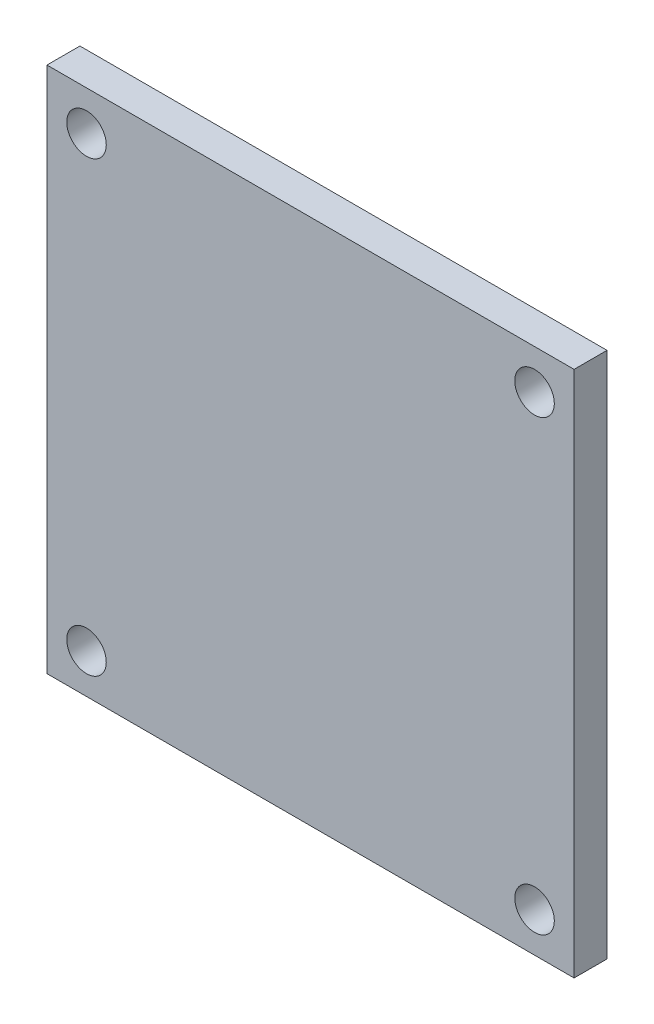
ISO-10303-21;
HEADER;
FILE_DESCRIPTION(('STEP AP214'),'2;1');
FILE_NAME('part.step','',(''),(''),'','','');
FILE_SCHEMA(('AUTOMOTIVE_DESIGN { 1 0 10303 214 1 1 1 1 }'));
ENDSEC;
DATA;
#1=APPLICATION_CONTEXT('core data for automotive mechanical design processes');
#2=APPLICATION_PROTOCOL_DEFINITION('international standard','automotive_design',2000,#1);
#3=PRODUCT_CONTEXT('',#1,'mechanical');
#4=PRODUCT('Part','Part','',(#3));
#5=PRODUCT_RELATED_PRODUCT_CATEGORY('part','',(#4));
#6=PRODUCT_DEFINITION_FORMATION('','',#4);
#7=PRODUCT_DEFINITION_CONTEXT('part definition',#1,'design');
#8=PRODUCT_DEFINITION('design','',#6,#7);
#9=PRODUCT_DEFINITION_SHAPE('','',#8);
#10=(LENGTH_UNIT() NAMED_UNIT(*) SI_UNIT(.MILLI.,.METRE.));
#11=(NAMED_UNIT(*) PLANE_ANGLE_UNIT() SI_UNIT($,.RADIAN.));
#12=(NAMED_UNIT(*) SI_UNIT($,.STERADIAN.) SOLID_ANGLE_UNIT());
#13=UNCERTAINTY_MEASURE_WITH_UNIT(LENGTH_MEASURE(1.E-05),#10,'distance_accuracy_value','');
#14=(GEOMETRIC_REPRESENTATION_CONTEXT(3) GLOBAL_UNCERTAINTY_ASSIGNED_CONTEXT((#13)) GLOBAL_UNIT_ASSIGNED_CONTEXT((#10,
#11,#12)) REPRESENTATION_CONTEXT('',''));
#15=CARTESIAN_POINT('',(0.,0.,0.));
#16=DIRECTION('',(0.,0.,1.));
#17=DIRECTION('',(1.,0.,0.));
#18=AXIS2_PLACEMENT_3D('',#15,#16,#17);
#19=CARTESIAN_POINT('',(0.,0.,2.5));
#20=DIRECTION('',(1.,0.,0.));
#21=DIRECTION('',(0.,0.,-1.));
#22=AXIS2_PLACEMENT_3D('',#19,#20,#21);
#23=PLANE('',#22);
#24=DIRECTION('',(0.,-1.,0.));
#25=VECTOR('',#24,1.);
#26=CARTESIAN_POINT('',(0.,0.,0.));
#27=LINE('',#26,#25);
#28=CARTESIAN_POINT('',(0.,40.,0.));
#29=VERTEX_POINT('',#28);
#30=CARTESIAN_POINT('',(0.,0.,0.));
#31=VERTEX_POINT('',#30);
#32=EDGE_CURVE('E96',#29,#31,#27,.T.);
#33=ORIENTED_EDGE('',*,*,#32,.T.);
#34=DIRECTION('',(0.,0.,-1.));
#35=VECTOR('',#34,1.);
#36=CARTESIAN_POINT('',(0.,0.,2.5));
#37=LINE('',#36,#35);
#38=CARTESIAN_POINT('',(0.,0.,2.5));
#39=VERTEX_POINT('',#38);
#40=EDGE_CURVE('E11',#39,#31,#37,.T.);
#41=ORIENTED_EDGE('',*,*,#40,.F.);
#42=DIRECTION('',(0.,-1.,0.));
#43=VECTOR('',#42,1.);
#44=CARTESIAN_POINT('',(0.,0.,2.5));
#45=LINE('',#44,#43);
#46=CARTESIAN_POINT('',(0.,40.,2.5));
#47=VERTEX_POINT('',#46);
#48=EDGE_CURVE('E84',#47,#39,#45,.T.);
#49=ORIENTED_EDGE('',*,*,#48,.F.);
#50=DIRECTION('',(0.,0.,-1.));
#51=VECTOR('',#50,1.);
#52=CARTESIAN_POINT('',(0.,40.,2.5));
#53=LINE('',#52,#51);
#54=EDGE_CURVE('E92',#47,#29,#53,.T.);
#55=ORIENTED_EDGE('',*,*,#54,.T.);
#56=EDGE_LOOP('',(#33,#41,#49,#55));
#57=FACE_BOUND('',#56,.T.);
#58=ADVANCED_FACE('F33',(#57),#23,.F.);
#59=CARTESIAN_POINT('',(0.,0.,2.5));
#60=DIRECTION('',(0.,1.,0.));
#61=DIRECTION('',(0.,0.,1.));
#62=AXIS2_PLACEMENT_3D('',#59,#60,#61);
#63=PLANE('',#62);
#64=DIRECTION('',(1.,0.,0.));
#65=VECTOR('',#64,1.);
#66=CARTESIAN_POINT('',(0.,0.,0.));
#67=LINE('',#66,#65);
#68=CARTESIAN_POINT('',(40.,0.,0.));
#69=VERTEX_POINT('',#68);
#70=EDGE_CURVE('E88',#31,#69,#67,.T.);
#71=ORIENTED_EDGE('',*,*,#70,.T.);
#72=DIRECTION('',(0.,0.,-1.));
#73=VECTOR('',#72,1.);
#74=CARTESIAN_POINT('',(40.,0.,2.5));
#75=LINE('',#74,#73);
#76=CARTESIAN_POINT('',(40.,0.,2.5));
#77=VERTEX_POINT('',#76);
#78=EDGE_CURVE('E41',#77,#69,#75,.T.);
#79=ORIENTED_EDGE('',*,*,#78,.F.);
#80=DIRECTION('',(1.,0.,0.));
#81=VECTOR('',#80,1.);
#82=CARTESIAN_POINT('',(0.,0.,2.5));
#83=LINE('',#82,#81);
#84=EDGE_CURVE('E79',#39,#77,#83,.T.);
#85=ORIENTED_EDGE('',*,*,#84,.F.);
#86=ORIENTED_EDGE('',*,*,#40,.T.);
#87=EDGE_LOOP('',(#71,#79,#85,#86));
#88=FACE_BOUND('',#87,.T.);
#89=ADVANCED_FACE('F87',(#88),#63,.F.);
#90=CARTESIAN_POINT('',(40.,0.,2.5));
#91=DIRECTION('',(-1.,0.,0.));
#92=DIRECTION('',(0.,0.,1.));
#93=AXIS2_PLACEMENT_3D('',#90,#91,#92);
#94=PLANE('',#93);
#95=DIRECTION('',(0.,1.,0.));
#96=VECTOR('',#95,1.);
#97=CARTESIAN_POINT('',(40.,0.,0.));
#98=LINE('',#97,#96);
#99=CARTESIAN_POINT('',(40.,40.,0.));
#100=VERTEX_POINT('',#99);
#101=EDGE_CURVE('E66',#69,#100,#98,.T.);
#102=ORIENTED_EDGE('',*,*,#101,.T.);
#103=DIRECTION('',(0.,0.,-1.));
#104=VECTOR('',#103,1.);
#105=CARTESIAN_POINT('',(40.,40.,2.5));
#106=LINE('',#105,#104);
#107=CARTESIAN_POINT('',(40.,40.,2.5));
#108=VERTEX_POINT('',#107);
#109=EDGE_CURVE('E89',#108,#100,#106,.T.);
#110=ORIENTED_EDGE('',*,*,#109,.F.);
#111=DIRECTION('',(0.,1.,0.));
#112=VECTOR('',#111,1.);
#113=CARTESIAN_POINT('',(40.,0.,2.5));
#114=LINE('',#113,#112);
#115=EDGE_CURVE('E82',#77,#108,#114,.T.);
#116=ORIENTED_EDGE('',*,*,#115,.F.);
#117=ORIENTED_EDGE('',*,*,#78,.T.);
#118=EDGE_LOOP('',(#102,#110,#116,#117));
#119=FACE_BOUND('',#118,.T.);
#120=ADVANCED_FACE('F90',(#119),#94,.F.);
#121=CARTESIAN_POINT('',(0.,40.,2.5));
#122=DIRECTION('',(0.,-1.,0.));
#123=DIRECTION('',(0.,0.,-1.));
#124=AXIS2_PLACEMENT_3D('',#121,#122,#123);
#125=PLANE('',#124);
#126=DIRECTION('',(-1.,0.,0.));
#127=VECTOR('',#126,1.);
#128=CARTESIAN_POINT('',(0.,40.,0.));
#129=LINE('',#128,#127);
#130=EDGE_CURVE('E72',#100,#29,#129,.T.);
#131=ORIENTED_EDGE('',*,*,#130,.T.);
#132=ORIENTED_EDGE('',*,*,#54,.F.);
#133=DIRECTION('',(-1.,0.,0.));
#134=VECTOR('',#133,1.);
#135=CARTESIAN_POINT('',(0.,40.,2.5));
#136=LINE('',#135,#134);
#137=EDGE_CURVE('E49',#108,#47,#136,.T.);
#138=ORIENTED_EDGE('',*,*,#137,.F.);
#139=ORIENTED_EDGE('',*,*,#109,.T.);
#140=EDGE_LOOP('',(#131,#132,#138,#139));
#141=FACE_BOUND('',#140,.T.);
#142=ADVANCED_FACE('F104',(#141),#125,.F.);
#143=CARTESIAN_POINT('',(0.,0.,2.5));
#144=DIRECTION('',(0.,0.,-1.));
#145=DIRECTION('',(-1.,0.,0.));
#146=AXIS2_PLACEMENT_3D('',#143,#144,#145);
#147=PLANE('',#146);
#148=CARTESIAN_POINT('',(3.,3.,2.5));
#149=DIRECTION('',(0.,0.,1.));
#150=DIRECTION('',(1.,0.,0.));
#151=AXIS2_PLACEMENT_3D('',#148,#149,#150);
#152=CIRCLE('',#151,1.5);
#153=CARTESIAN_POINT('',(4.5,3.,2.5));
#154=VERTEX_POINT('',#153);
#155=EDGE_CURVE('E116',#154,#154,#152,.T.);
#156=ORIENTED_EDGE('',*,*,#155,.F.);
#157=EDGE_LOOP('',(#156));
#158=FACE_BOUND('',#157,.T.);
#159=CARTESIAN_POINT('',(37.,3.,2.5));
#160=DIRECTION('',(0.,0.,1.));
#161=DIRECTION('',(1.,0.,0.));
#162=AXIS2_PLACEMENT_3D('',#159,#160,#161);
#163=CIRCLE('',#162,1.5);
#164=CARTESIAN_POINT('',(38.5,3.,2.5));
#165=VERTEX_POINT('',#164);
#166=EDGE_CURVE('E122',#165,#165,#163,.T.);
#167=ORIENTED_EDGE('',*,*,#166,.F.);
#168=EDGE_LOOP('',(#167));
#169=FACE_BOUND('',#168,.T.);
#170=CARTESIAN_POINT('',(37.,37.,2.5));
#171=DIRECTION('',(0.,0.,1.));
#172=DIRECTION('',(1.,0.,0.));
#173=AXIS2_PLACEMENT_3D('',#170,#171,#172);
#174=CIRCLE('',#173,1.5);
#175=CARTESIAN_POINT('',(38.5,37.,2.5));
#176=VERTEX_POINT('',#175);
#177=EDGE_CURVE('E128',#176,#176,#174,.T.);
#178=ORIENTED_EDGE('',*,*,#177,.F.);
#179=EDGE_LOOP('',(#178));
#180=FACE_BOUND('',#179,.T.);
#181=CARTESIAN_POINT('',(3.,37.,2.5));
#182=DIRECTION('',(0.,0.,1.));
#183=DIRECTION('',(1.,0.,0.));
#184=AXIS2_PLACEMENT_3D('',#181,#182,#183);
#185=CIRCLE('',#184,1.5);
#186=CARTESIAN_POINT('',(4.5,37.,2.5));
#187=VERTEX_POINT('',#186);
#188=EDGE_CURVE('E110',#187,#187,#185,.T.);
#189=ORIENTED_EDGE('',*,*,#188,.F.);
#190=EDGE_LOOP('',(#189));
#191=FACE_BOUND('',#190,.T.);
#192=ORIENTED_EDGE('',*,*,#48,.T.);
#193=ORIENTED_EDGE('',*,*,#84,.T.);
#194=ORIENTED_EDGE('',*,*,#115,.T.);
#195=ORIENTED_EDGE('',*,*,#137,.T.);
#196=EDGE_LOOP('',(#192,#193,#194,#195));
#197=FACE_BOUND('',#196,.T.);
#198=ADVANCED_FACE('F80',(#158,#169,#180,#191,#197),#147,.F.);
#199=CARTESIAN_POINT('',(0.,0.,0.));
#200=DIRECTION('',(0.,0.,-1.));
#201=DIRECTION('',(-1.,0.,0.));
#202=AXIS2_PLACEMENT_3D('',#199,#200,#201);
#203=PLANE('',#202);
#204=CARTESIAN_POINT('',(3.,3.,0.));
#205=DIRECTION('',(0.,0.,1.));
#206=DIRECTION('',(1.,0.,0.));
#207=AXIS2_PLACEMENT_3D('',#204,#205,#206);
#208=CIRCLE('',#207,1.5);
#209=CARTESIAN_POINT('',(4.5,3.,0.));
#210=VERTEX_POINT('',#209);
#211=EDGE_CURVE('E119',#210,#210,#208,.T.);
#212=ORIENTED_EDGE('',*,*,#211,.T.);
#213=EDGE_LOOP('',(#212));
#214=FACE_BOUND('',#213,.T.);
#215=CARTESIAN_POINT('',(37.,3.,0.));
#216=DIRECTION('',(0.,0.,1.));
#217=DIRECTION('',(1.,0.,0.));
#218=AXIS2_PLACEMENT_3D('',#215,#216,#217);
#219=CIRCLE('',#218,1.5);
#220=CARTESIAN_POINT('',(38.5,3.,0.));
#221=VERTEX_POINT('',#220);
#222=EDGE_CURVE('E125',#221,#221,#219,.T.);
#223=ORIENTED_EDGE('',*,*,#222,.T.);
#224=EDGE_LOOP('',(#223));
#225=FACE_BOUND('',#224,.T.);
#226=CARTESIAN_POINT('',(37.,37.,0.));
#227=DIRECTION('',(0.,0.,1.));
#228=DIRECTION('',(1.,0.,0.));
#229=AXIS2_PLACEMENT_3D('',#226,#227,#228);
#230=CIRCLE('',#229,1.5);
#231=CARTESIAN_POINT('',(38.5,37.,0.));
#232=VERTEX_POINT('',#231);
#233=EDGE_CURVE('E113',#232,#232,#230,.T.);
#234=ORIENTED_EDGE('',*,*,#233,.T.);
#235=EDGE_LOOP('',(#234));
#236=FACE_BOUND('',#235,.T.);
#237=CARTESIAN_POINT('',(3.,37.,0.));
#238=DIRECTION('',(0.,0.,1.));
#239=DIRECTION('',(1.,0.,0.));
#240=AXIS2_PLACEMENT_3D('',#237,#238,#239);
#241=CIRCLE('',#240,1.5);
#242=CARTESIAN_POINT('',(4.5,37.,0.));
#243=VERTEX_POINT('',#242);
#244=EDGE_CURVE('E99',#243,#243,#241,.T.);
#245=ORIENTED_EDGE('',*,*,#244,.T.);
#246=EDGE_LOOP('',(#245));
#247=FACE_BOUND('',#246,.T.);
#248=ORIENTED_EDGE('',*,*,#32,.F.);
#249=ORIENTED_EDGE('',*,*,#130,.F.);
#250=ORIENTED_EDGE('',*,*,#101,.F.);
#251=ORIENTED_EDGE('',*,*,#70,.F.);
#252=EDGE_LOOP('',(#248,#249,#250,#251));
#253=FACE_BOUND('',#252,.T.);
#254=ADVANCED_FACE('F107',(#214,#225,#236,#247,#253),#203,.T.);
#255=CARTESIAN_POINT('',(3.,37.,0.));
#256=DIRECTION('',(0.,0.,1.));
#257=DIRECTION('',(1.,0.,0.));
#258=AXIS2_PLACEMENT_3D('',#255,#256,#257);
#259=CYLINDRICAL_SURFACE('',#258,1.5);
#260=ORIENTED_EDGE('',*,*,#244,.F.);
#261=EDGE_LOOP('',(#260));
#262=FACE_BOUND('',#261,.T.);
#263=ORIENTED_EDGE('',*,*,#188,.T.);
#264=EDGE_LOOP('',(#263));
#265=FACE_BOUND('',#264,.T.);
#266=ADVANCED_FACE('F140',(#262,#265),#259,.F.);
#267=CARTESIAN_POINT('',(37.,37.,0.));
#268=DIRECTION('',(0.,0.,1.));
#269=DIRECTION('',(1.,0.,0.));
#270=AXIS2_PLACEMENT_3D('',#267,#268,#269);
#271=CYLINDRICAL_SURFACE('',#270,1.5);
#272=ORIENTED_EDGE('',*,*,#233,.F.);
#273=EDGE_LOOP('',(#272));
#274=FACE_BOUND('',#273,.T.);
#275=ORIENTED_EDGE('',*,*,#177,.T.);
#276=EDGE_LOOP('',(#275));
#277=FACE_BOUND('',#276,.T.);
#278=ADVANCED_FACE('F136',(#274,#277),#271,.F.);
#279=CARTESIAN_POINT('',(37.,3.,0.));
#280=DIRECTION('',(0.,0.,1.));
#281=DIRECTION('',(1.,0.,0.));
#282=AXIS2_PLACEMENT_3D('',#279,#280,#281);
#283=CYLINDRICAL_SURFACE('',#282,1.5);
#284=ORIENTED_EDGE('',*,*,#222,.F.);
#285=EDGE_LOOP('',(#284));
#286=FACE_BOUND('',#285,.T.);
#287=ORIENTED_EDGE('',*,*,#166,.T.);
#288=EDGE_LOOP('',(#287));
#289=FACE_BOUND('',#288,.T.);
#290=ADVANCED_FACE('F139',(#286,#289),#283,.F.);
#291=CARTESIAN_POINT('',(3.,3.,0.));
#292=DIRECTION('',(0.,0.,1.));
#293=DIRECTION('',(1.,0.,0.));
#294=AXIS2_PLACEMENT_3D('',#291,#292,#293);
#295=CYLINDRICAL_SURFACE('',#294,1.5);
#296=ORIENTED_EDGE('',*,*,#211,.F.);
#297=EDGE_LOOP('',(#296));
#298=FACE_BOUND('',#297,.T.);
#299=ORIENTED_EDGE('',*,*,#155,.T.);
#300=EDGE_LOOP('',(#299));
#301=FACE_BOUND('',#300,.T.);
#302=ADVANCED_FACE('F201',(#298,#301),#295,.F.);
#303=CLOSED_SHELL('',(#58,#89,#120,#142,#198,#254,#266,#278,#290,#302));
#304=MANIFOLD_SOLID_BREP('B2',#303);
#305=ADVANCED_BREP_SHAPE_REPRESENTATION('',(#18,#304),#14);
#306=SHAPE_DEFINITION_REPRESENTATION(#9,#305);
ENDSEC;
END-ISO-10303-21;
